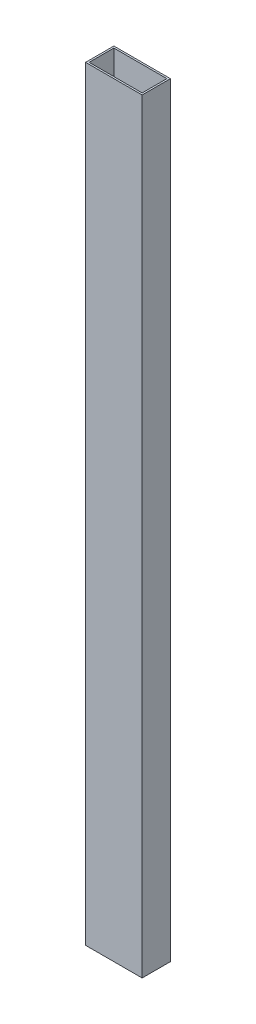
ISO-10303-21;
HEADER;
FILE_DESCRIPTION(('STEP AP214'),'2;1');
FILE_NAME('part.step','',(''),(''),'','','');
FILE_SCHEMA(('AUTOMOTIVE_DESIGN { 1 0 10303 214 1 1 1 1 }'));
ENDSEC;
DATA;
#1=APPLICATION_CONTEXT('core data for automotive mechanical design processes');
#2=APPLICATION_PROTOCOL_DEFINITION('international standard','automotive_design',2000,#1);
#3=PRODUCT_CONTEXT('',#1,'mechanical');
#4=PRODUCT('Part','Part','',(#3));
#5=PRODUCT_RELATED_PRODUCT_CATEGORY('part','',(#4));
#6=PRODUCT_DEFINITION_FORMATION('','',#4);
#7=PRODUCT_DEFINITION_CONTEXT('part definition',#1,'design');
#8=PRODUCT_DEFINITION('design','',#6,#7);
#9=PRODUCT_DEFINITION_SHAPE('','',#8);
#10=(LENGTH_UNIT() NAMED_UNIT(*) SI_UNIT(.MILLI.,.METRE.));
#11=(NAMED_UNIT(*) PLANE_ANGLE_UNIT() SI_UNIT($,.RADIAN.));
#12=(NAMED_UNIT(*) SI_UNIT($,.STERADIAN.) SOLID_ANGLE_UNIT());
#13=UNCERTAINTY_MEASURE_WITH_UNIT(LENGTH_MEASURE(1.E-05),#10,'distance_accuracy_value','');
#14=(GEOMETRIC_REPRESENTATION_CONTEXT(3) GLOBAL_UNCERTAINTY_ASSIGNED_CONTEXT((#13)) GLOBAL_UNIT_ASSIGNED_CONTEXT((#10,
#11,#12)) REPRESENTATION_CONTEXT('',''));
#15=CARTESIAN_POINT('',(0.,0.,0.));
#16=DIRECTION('',(0.,0.,1.));
#17=DIRECTION('',(1.,0.,0.));
#18=AXIS2_PLACEMENT_3D('',#15,#16,#17);
#19=CARTESIAN_POINT('',(0.,687.07,0.));
#20=DIRECTION('',(0.,1.,0.));
#21=DIRECTION('',(0.,0.,1.));
#22=AXIS2_PLACEMENT_3D('',#19,#20,#21);
#23=PLANE('',#22);
#24=DIRECTION('',(0.,0.,1.));
#25=VECTOR('',#24,1.);
#26=CARTESIAN_POINT('',(-13.1274038461538,687.07,-4.85408653846153));
#27=LINE('',#26,#25);
#28=CARTESIAN_POINT('',(-13.1274038461538,687.07,-4.85408653846153));
#29=VERTEX_POINT('',#28);
#30=CARTESIAN_POINT('',(-13.1274038461538,687.07,20.5459134615385));
#31=VERTEX_POINT('',#30);
#32=EDGE_CURVE('E153',#29,#31,#27,.T.);
#33=ORIENTED_EDGE('',*,*,#32,.T.);
#34=DIRECTION('',(1.,0.,0.));
#35=VECTOR('',#34,1.);
#36=CARTESIAN_POINT('',(-13.1274038461538,687.07,20.5459134615385));
#37=LINE('',#36,#35);
#38=CARTESIAN_POINT('',(37.6725961538462,687.07,20.5459134615385));
#39=VERTEX_POINT('',#38);
#40=EDGE_CURVE('E157',#31,#39,#37,.T.);
#41=ORIENTED_EDGE('',*,*,#40,.T.);
#42=DIRECTION('',(0.,0.,-1.));
#43=VECTOR('',#42,1.);
#44=CARTESIAN_POINT('',(37.6725961538462,687.07,-4.85408653846153));
#45=LINE('',#44,#43);
#46=CARTESIAN_POINT('',(37.6725961538462,687.07,-4.85408653846153));
#47=VERTEX_POINT('',#46);
#48=EDGE_CURVE('E161',#39,#47,#45,.T.);
#49=ORIENTED_EDGE('',*,*,#48,.T.);
#50=DIRECTION('',(-1.,0.,0.));
#51=VECTOR('',#50,1.);
#52=CARTESIAN_POINT('',(-13.1274038461538,687.07,-4.85408653846153));
#53=LINE('',#52,#51);
#54=EDGE_CURVE('E164',#47,#29,#53,.T.);
#55=ORIENTED_EDGE('',*,*,#54,.T.);
#56=EDGE_LOOP('',(#33,#41,#49,#55));
#57=FACE_BOUND('',#56,.T.);
#58=DIRECTION('',(1.,0.,0.));
#59=VECTOR('',#58,1.);
#60=CARTESIAN_POINT('',(-11.5399038461538,687.07,18.9584134615385));
#61=LINE('',#60,#59);
#62=CARTESIAN_POINT('',(-11.5399038461538,687.07,18.9584134615385));
#63=VERTEX_POINT('',#62);
#64=CARTESIAN_POINT('',(36.0850961538462,687.07,18.9584134615385));
#65=VERTEX_POINT('',#64);
#66=EDGE_CURVE('E114',#63,#65,#61,.T.);
#67=ORIENTED_EDGE('',*,*,#66,.F.);
#68=DIRECTION('',(0.,0.,1.));
#69=VECTOR('',#68,1.);
#70=CARTESIAN_POINT('',(-11.5399038461538,687.07,-3.26658653846153));
#71=LINE('',#70,#69);
#72=CARTESIAN_POINT('',(-11.5399038461538,687.07,-3.26658653846153));
#73=VERTEX_POINT('',#72);
#74=EDGE_CURVE('E105',#73,#63,#71,.T.);
#75=ORIENTED_EDGE('',*,*,#74,.F.);
#76=DIRECTION('',(-1.,0.,0.));
#77=VECTOR('',#76,1.);
#78=CARTESIAN_POINT('',(-11.5399038461538,687.07,-3.26658653846153));
#79=LINE('',#78,#77);
#80=CARTESIAN_POINT('',(36.0850961538462,687.07,-3.26658653846153));
#81=VERTEX_POINT('',#80);
#82=EDGE_CURVE('E131',#81,#73,#79,.T.);
#83=ORIENTED_EDGE('',*,*,#82,.F.);
#84=DIRECTION('',(0.,0.,-1.));
#85=VECTOR('',#84,1.);
#86=CARTESIAN_POINT('',(36.0850961538462,687.07,-3.26658653846153));
#87=LINE('',#86,#85);
#88=EDGE_CURVE('E127',#65,#81,#87,.T.);
#89=ORIENTED_EDGE('',*,*,#88,.F.);
#90=EDGE_LOOP('',(#67,#75,#83,#89));
#91=FACE_BOUND('',#90,.T.);
#92=ADVANCED_FACE('F39',(#57,#91),#23,.T.);
#93=CARTESIAN_POINT('',(0.,0.,0.));
#94=DIRECTION('',(0.,1.,0.));
#95=DIRECTION('',(0.,0.,1.));
#96=AXIS2_PLACEMENT_3D('',#93,#94,#95);
#97=PLANE('',#96);
#98=DIRECTION('',(0.,0.,1.));
#99=VECTOR('',#98,1.);
#100=CARTESIAN_POINT('',(-13.1274038461538,0.,-4.85408653846153));
#101=LINE('',#100,#99);
#102=CARTESIAN_POINT('',(-13.1274038461538,0.,-4.85408653846153));
#103=VERTEX_POINT('',#102);
#104=CARTESIAN_POINT('',(-13.1274038461538,0.,20.5459134615385));
#105=VERTEX_POINT('',#104);
#106=EDGE_CURVE('E123',#103,#105,#101,.T.);
#107=ORIENTED_EDGE('',*,*,#106,.F.);
#108=DIRECTION('',(-1.,0.,0.));
#109=VECTOR('',#108,1.);
#110=CARTESIAN_POINT('',(-13.1274038461538,0.,-4.85408653846153));
#111=LINE('',#110,#109);
#112=CARTESIAN_POINT('',(37.6725961538462,0.,-4.85408653846153));
#113=VERTEX_POINT('',#112);
#114=EDGE_CURVE('E158',#113,#103,#111,.T.);
#115=ORIENTED_EDGE('',*,*,#114,.F.);
#116=DIRECTION('',(0.,0.,-1.));
#117=VECTOR('',#116,1.);
#118=CARTESIAN_POINT('',(37.6725961538462,0.,-4.85408653846153));
#119=LINE('',#118,#117);
#120=CARTESIAN_POINT('',(37.6725961538462,0.,20.5459134615385));
#121=VERTEX_POINT('',#120);
#122=EDGE_CURVE('E174',#121,#113,#119,.T.);
#123=ORIENTED_EDGE('',*,*,#122,.F.);
#124=DIRECTION('',(1.,0.,0.));
#125=VECTOR('',#124,1.);
#126=CARTESIAN_POINT('',(-13.1274038461538,0.,20.5459134615385));
#127=LINE('',#126,#125);
#128=EDGE_CURVE('E171',#105,#121,#127,.T.);
#129=ORIENTED_EDGE('',*,*,#128,.F.);
#130=EDGE_LOOP('',(#107,#115,#123,#129));
#131=FACE_BOUND('',#130,.T.);
#132=DIRECTION('',(0.,0.,1.));
#133=VECTOR('',#132,1.);
#134=CARTESIAN_POINT('',(-11.5399038461538,0.,-3.26658653846153));
#135=LINE('',#134,#133);
#136=CARTESIAN_POINT('',(-11.5399038461538,0.,-3.26658653846153));
#137=VERTEX_POINT('',#136);
#138=CARTESIAN_POINT('',(-11.5399038461538,0.,18.9584134615385));
#139=VERTEX_POINT('',#138);
#140=EDGE_CURVE('E63',#137,#139,#135,.T.);
#141=ORIENTED_EDGE('',*,*,#140,.T.);
#142=DIRECTION('',(1.,0.,0.));
#143=VECTOR('',#142,1.);
#144=CARTESIAN_POINT('',(-11.5399038461538,0.,18.9584134615385));
#145=LINE('',#144,#143);
#146=CARTESIAN_POINT('',(36.0850961538462,0.,18.9584134615385));
#147=VERTEX_POINT('',#146);
#148=EDGE_CURVE('E121',#139,#147,#145,.T.);
#149=ORIENTED_EDGE('',*,*,#148,.T.);
#150=DIRECTION('',(0.,0.,-1.));
#151=VECTOR('',#150,1.);
#152=CARTESIAN_POINT('',(36.0850961538462,0.,-3.26658653846153));
#153=LINE('',#152,#151);
#154=CARTESIAN_POINT('',(36.0850961538462,0.,-3.26658653846153));
#155=VERTEX_POINT('',#154);
#156=EDGE_CURVE('E140',#147,#155,#153,.T.);
#157=ORIENTED_EDGE('',*,*,#156,.T.);
#158=DIRECTION('',(-1.,0.,0.));
#159=VECTOR('',#158,1.);
#160=CARTESIAN_POINT('',(-11.5399038461538,0.,-3.26658653846153));
#161=LINE('',#160,#159);
#162=EDGE_CURVE('E115',#155,#137,#161,.T.);
#163=ORIENTED_EDGE('',*,*,#162,.T.);
#164=EDGE_LOOP('',(#141,#149,#157,#163));
#165=FACE_BOUND('',#164,.T.);
#166=ADVANCED_FACE('F197',(#131,#165),#97,.F.);
#167=CARTESIAN_POINT('',(-13.1274038461538,687.07,-4.85408653846153));
#168=DIRECTION('',(1.,0.,0.));
#169=DIRECTION('',(0.,0.,-1.));
#170=AXIS2_PLACEMENT_3D('',#167,#168,#169);
#171=PLANE('',#170);
#172=ORIENTED_EDGE('',*,*,#106,.T.);
#173=DIRECTION('',(0.,-1.,0.));
#174=VECTOR('',#173,1.);
#175=CARTESIAN_POINT('',(-13.1274038461538,687.07,20.5459134615385));
#176=LINE('',#175,#174);
#177=EDGE_CURVE('E11',#31,#105,#176,.T.);
#178=ORIENTED_EDGE('',*,*,#177,.F.);
#179=ORIENTED_EDGE('',*,*,#32,.F.);
#180=DIRECTION('',(0.,-1.,0.));
#181=VECTOR('',#180,1.);
#182=CARTESIAN_POINT('',(-13.1274038461538,687.07,-4.85408653846153));
#183=LINE('',#182,#181);
#184=EDGE_CURVE('E167',#29,#103,#183,.T.);
#185=ORIENTED_EDGE('',*,*,#184,.T.);
#186=EDGE_LOOP('',(#172,#178,#179,#185));
#187=FACE_BOUND('',#186,.T.);
#188=ADVANCED_FACE('F41',(#187),#171,.F.);
#189=CARTESIAN_POINT('',(-13.1274038461538,687.07,20.5459134615385));
#190=DIRECTION('',(0.,0.,-1.));
#191=DIRECTION('',(-1.,0.,0.));
#192=AXIS2_PLACEMENT_3D('',#189,#190,#191);
#193=PLANE('',#192);
#194=ORIENTED_EDGE('',*,*,#128,.T.);
#195=DIRECTION('',(0.,-1.,0.));
#196=VECTOR('',#195,1.);
#197=CARTESIAN_POINT('',(37.6725961538462,687.07,20.5459134615385));
#198=LINE('',#197,#196);
#199=EDGE_CURVE('E48',#39,#121,#198,.T.);
#200=ORIENTED_EDGE('',*,*,#199,.F.);
#201=ORIENTED_EDGE('',*,*,#40,.F.);
#202=ORIENTED_EDGE('',*,*,#177,.T.);
#203=EDGE_LOOP('',(#194,#200,#201,#202));
#204=FACE_BOUND('',#203,.T.);
#205=ADVANCED_FACE('F207',(#204),#193,.F.);
#206=CARTESIAN_POINT('',(37.6725961538462,687.07,-4.85408653846153));
#207=DIRECTION('',(-1.,0.,0.));
#208=DIRECTION('',(0.,0.,1.));
#209=AXIS2_PLACEMENT_3D('',#206,#207,#208);
#210=PLANE('',#209);
#211=ORIENTED_EDGE('',*,*,#122,.T.);
#212=DIRECTION('',(0.,-1.,0.));
#213=VECTOR('',#212,1.);
#214=CARTESIAN_POINT('',(37.6725961538462,687.07,-4.85408653846153));
#215=LINE('',#214,#213);
#216=EDGE_CURVE('E182',#47,#113,#215,.T.);
#217=ORIENTED_EDGE('',*,*,#216,.F.);
#218=ORIENTED_EDGE('',*,*,#48,.F.);
#219=ORIENTED_EDGE('',*,*,#199,.T.);
#220=EDGE_LOOP('',(#211,#217,#218,#219));
#221=FACE_BOUND('',#220,.T.);
#222=ADVANCED_FACE('F191',(#221),#210,.F.);
#223=CARTESIAN_POINT('',(-13.1274038461538,687.07,-4.85408653846153));
#224=DIRECTION('',(0.,0.,1.));
#225=DIRECTION('',(1.,0.,0.));
#226=AXIS2_PLACEMENT_3D('',#223,#224,#225);
#227=PLANE('',#226);
#228=ORIENTED_EDGE('',*,*,#114,.T.);
#229=ORIENTED_EDGE('',*,*,#184,.F.);
#230=ORIENTED_EDGE('',*,*,#54,.F.);
#231=ORIENTED_EDGE('',*,*,#216,.T.);
#232=EDGE_LOOP('',(#228,#229,#230,#231));
#233=FACE_BOUND('',#232,.T.);
#234=ADVANCED_FACE('F201',(#233),#227,.F.);
#235=CARTESIAN_POINT('',(-11.5399038461538,687.07,-3.26658653846153));
#236=DIRECTION('',(1.,0.,0.));
#237=DIRECTION('',(0.,0.,-1.));
#238=AXIS2_PLACEMENT_3D('',#235,#236,#237);
#239=PLANE('',#238);
#240=ORIENTED_EDGE('',*,*,#140,.F.);
#241=DIRECTION('',(0.,-1.,0.));
#242=VECTOR('',#241,1.);
#243=CARTESIAN_POINT('',(-11.5399038461538,687.07,-3.26658653846153));
#244=LINE('',#243,#242);
#245=EDGE_CURVE('E109',#73,#137,#244,.T.);
#246=ORIENTED_EDGE('',*,*,#245,.F.);
#247=ORIENTED_EDGE('',*,*,#74,.T.);
#248=DIRECTION('',(0.,-1.,0.));
#249=VECTOR('',#248,1.);
#250=CARTESIAN_POINT('',(-11.5399038461538,687.07,18.9584134615385));
#251=LINE('',#250,#249);
#252=EDGE_CURVE('E108',#63,#139,#251,.T.);
#253=ORIENTED_EDGE('',*,*,#252,.T.);
#254=EDGE_LOOP('',(#240,#246,#247,#253));
#255=FACE_BOUND('',#254,.T.);
#256=ADVANCED_FACE('F107',(#255),#239,.T.);
#257=CARTESIAN_POINT('',(-11.5399038461538,687.07,18.9584134615385));
#258=DIRECTION('',(0.,0.,-1.));
#259=DIRECTION('',(-1.,0.,0.));
#260=AXIS2_PLACEMENT_3D('',#257,#258,#259);
#261=PLANE('',#260);
#262=ORIENTED_EDGE('',*,*,#148,.F.);
#263=ORIENTED_EDGE('',*,*,#252,.F.);
#264=ORIENTED_EDGE('',*,*,#66,.T.);
#265=DIRECTION('',(0.,-1.,0.));
#266=VECTOR('',#265,1.);
#267=CARTESIAN_POINT('',(36.0850961538462,687.07,18.9584134615385));
#268=LINE('',#267,#266);
#269=EDGE_CURVE('E124',#65,#147,#268,.T.);
#270=ORIENTED_EDGE('',*,*,#269,.T.);
#271=EDGE_LOOP('',(#262,#263,#264,#270));
#272=FACE_BOUND('',#271,.T.);
#273=ADVANCED_FACE('F118',(#272),#261,.T.);
#274=CARTESIAN_POINT('',(36.0850961538462,687.07,-3.26658653846153));
#275=DIRECTION('',(-1.,0.,0.));
#276=DIRECTION('',(0.,0.,1.));
#277=AXIS2_PLACEMENT_3D('',#274,#275,#276);
#278=PLANE('',#277);
#279=ORIENTED_EDGE('',*,*,#156,.F.);
#280=ORIENTED_EDGE('',*,*,#269,.F.);
#281=ORIENTED_EDGE('',*,*,#88,.T.);
#282=DIRECTION('',(0.,-1.,0.));
#283=VECTOR('',#282,1.);
#284=CARTESIAN_POINT('',(36.0850961538462,687.07,-3.26658653846153));
#285=LINE('',#284,#283);
#286=EDGE_CURVE('E55',#81,#155,#285,.T.);
#287=ORIENTED_EDGE('',*,*,#286,.T.);
#288=EDGE_LOOP('',(#279,#280,#281,#287));
#289=FACE_BOUND('',#288,.T.);
#290=ADVANCED_FACE('F230',(#289),#278,.T.);
#291=CARTESIAN_POINT('',(-11.5399038461538,687.07,-3.26658653846153));
#292=DIRECTION('',(0.,0.,1.));
#293=DIRECTION('',(1.,0.,0.));
#294=AXIS2_PLACEMENT_3D('',#291,#292,#293);
#295=PLANE('',#294);
#296=ORIENTED_EDGE('',*,*,#162,.F.);
#297=ORIENTED_EDGE('',*,*,#286,.F.);
#298=ORIENTED_EDGE('',*,*,#82,.T.);
#299=ORIENTED_EDGE('',*,*,#245,.T.);
#300=EDGE_LOOP('',(#296,#297,#298,#299));
#301=FACE_BOUND('',#300,.T.);
#302=ADVANCED_FACE('F234',(#301),#295,.T.);
#303=CLOSED_SHELL('',(#92,#166,#188,#205,#222,#234,#256,#273,#290,#302));
#304=MANIFOLD_SOLID_BREP('B2',#303);
#305=ADVANCED_BREP_SHAPE_REPRESENTATION('',(#18,#304),#14);
#306=SHAPE_DEFINITION_REPRESENTATION(#9,#305);
ENDSEC;
END-ISO-10303-21;
